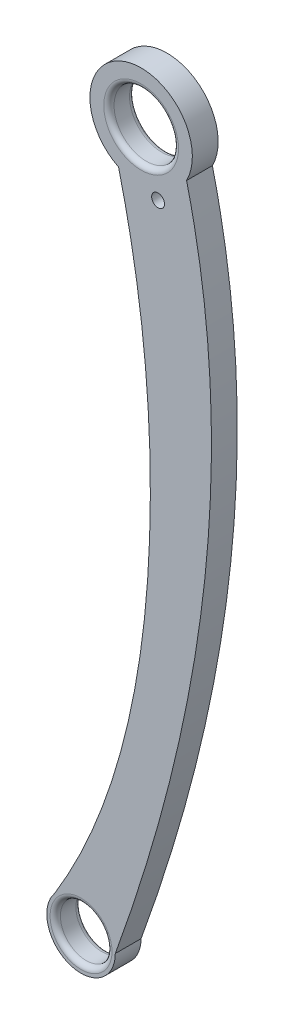
ISO-10303-21;
HEADER;
FILE_DESCRIPTION(('STEP AP214'),'2;1');
FILE_NAME('part.step','',(''),(''),'','','');
FILE_SCHEMA(('AUTOMOTIVE_DESIGN { 1 0 10303 214 1 1 1 1 }'));
ENDSEC;
DATA;
#1=APPLICATION_CONTEXT('core data for automotive mechanical design processes');
#2=APPLICATION_PROTOCOL_DEFINITION('international standard','automotive_design',2000,#1);
#3=PRODUCT_CONTEXT('',#1,'mechanical');
#4=PRODUCT('Part','Part','',(#3));
#5=PRODUCT_RELATED_PRODUCT_CATEGORY('part','',(#4));
#6=PRODUCT_DEFINITION_FORMATION('','',#4);
#7=PRODUCT_DEFINITION_CONTEXT('part definition',#1,'design');
#8=PRODUCT_DEFINITION('design','',#6,#7);
#9=PRODUCT_DEFINITION_SHAPE('','',#8);
#10=(LENGTH_UNIT() NAMED_UNIT(*) SI_UNIT(.MILLI.,.METRE.));
#11=(NAMED_UNIT(*) PLANE_ANGLE_UNIT() SI_UNIT($,.RADIAN.));
#12=(NAMED_UNIT(*) SI_UNIT($,.STERADIAN.) SOLID_ANGLE_UNIT());
#13=UNCERTAINTY_MEASURE_WITH_UNIT(LENGTH_MEASURE(1.E-05),#10,'distance_accuracy_value','');
#14=(GEOMETRIC_REPRESENTATION_CONTEXT(3) GLOBAL_UNCERTAINTY_ASSIGNED_CONTEXT((#13)) GLOBAL_UNIT_ASSIGNED_CONTEXT((#10,
#11,#12)) REPRESENTATION_CONTEXT('',''));
#15=CARTESIAN_POINT('',(0.,0.,0.));
#16=DIRECTION('',(0.,0.,1.));
#17=DIRECTION('',(1.,0.,0.));
#18=AXIS2_PLACEMENT_3D('',#15,#16,#17);
#19=CARTESIAN_POINT('',(5.31163662416243,0.,2.));
#20=CARTESIAN_POINT('',(18.3321974291525,35.9770453277798,2.));
#21=CARTESIAN_POINT('',(25.8524713877019,76.6433302799412,2.));
#22=CARTESIAN_POINT('',(15.073892360451,114.258525244082,2.));
#23=B_SPLINE_CURVE_WITH_KNOTS('',3,(#19,#20,#21,#22),.UNSPECIFIED.,.F.,.F.,(4,4),(0.,1.),.UNSPECIFIED.);
#24=DIRECTION('',(0.,0.,-1.));
#25=VECTOR('',#24,1.);
#26=SURFACE_OF_LINEAR_EXTRUSION('',#23,#25);
#27=CARTESIAN_POINT('',(5.31163662416243,0.,-2.));
#28=CARTESIAN_POINT('',(18.3321974291525,35.9770453277798,-2.));
#29=CARTESIAN_POINT('',(25.8524713877019,76.6433302799412,-2.));
#30=CARTESIAN_POINT('',(15.073892360451,114.258525244082,-2.));
#31=B_SPLINE_CURVE_WITH_KNOTS('',3,(#27,#28,#29,#30),.UNSPECIFIED.,.F.,.F.,(4,4),(0.,1.),.UNSPECIFIED.);
#32=CARTESIAN_POINT('',(5.31163662416243,0.,-2.));
#33=VERTEX_POINT('',#32);
#34=CARTESIAN_POINT('',(16.3701122695704,109.364122198897,-2.));
#35=VERTEX_POINT('',#34);
#36=EDGE_CURVE('E202',#33,#35,#31,.T.);
#37=ORIENTED_EDGE('',*,*,#36,.T.);
#38=DIRECTION('',(0.,0.,-1.));
#39=VECTOR('',#38,1.);
#40=CARTESIAN_POINT('',(16.3701122695704,109.364122198897,2.));
#41=LINE('',#40,#39);
#42=CARTESIAN_POINT('',(16.3701122695704,109.364122198897,2.));
#43=VERTEX_POINT('',#42);
#44=EDGE_CURVE('E98',#43,#35,#41,.T.);
#45=ORIENTED_EDGE('',*,*,#44,.F.);
#46=CARTESIAN_POINT('',(5.31163662416243,0.,2.));
#47=VERTEX_POINT('',#46);
#48=EDGE_CURVE('E88',#47,#43,#23,.T.);
#49=ORIENTED_EDGE('',*,*,#48,.F.);
#50=DIRECTION('',(0.,0.,-1.));
#51=VECTOR('',#50,1.);
#52=CARTESIAN_POINT('',(5.31163662416243,0.,2.));
#53=LINE('',#52,#51);
#54=EDGE_CURVE('E141',#47,#33,#53,.T.);
#55=ORIENTED_EDGE('',*,*,#54,.T.);
#56=EDGE_LOOP('',(#37,#45,#49,#55));
#57=FACE_BOUND('',#56,.T.);
#58=ADVANCED_FACE('F38',(#57),#26,.F.);
#59=CARTESIAN_POINT('',(9.32113061310812,113.027146637179,2.));
#60=DIRECTION('',(0.,0.,-1.));
#61=DIRECTION('',(-1.,0.,0.));
#62=AXIS2_PLACEMENT_3D('',#59,#60,#61);
#63=CYLINDRICAL_SURFACE('',#62,7.94392160262143);
#64=CARTESIAN_POINT('',(9.32113061310812,113.027146637179,-2.));
#65=DIRECTION('',(0.,0.,1.));
#66=DIRECTION('',(1.,0.,0.));
#67=AXIS2_PLACEMENT_3D('',#64,#65,#66);
#68=CIRCLE('',#67,7.94392160262143);
#69=CARTESIAN_POINT('',(5.81715706753299,105.897766592568,-2.));
#70=VERTEX_POINT('',#69);
#71=EDGE_CURVE('E94',#35,#70,#68,.T.);
#72=ORIENTED_EDGE('',*,*,#71,.T.);
#73=DIRECTION('',(0.,0.,-1.));
#74=VECTOR('',#73,1.);
#75=CARTESIAN_POINT('',(5.81715706753299,105.897766592568,2.));
#76=LINE('',#75,#74);
#77=CARTESIAN_POINT('',(5.81715706753299,105.897766592568,2.));
#78=VERTEX_POINT('',#77);
#79=EDGE_CURVE('E92',#78,#70,#76,.T.);
#80=ORIENTED_EDGE('',*,*,#79,.F.);
#81=CARTESIAN_POINT('',(9.32113061310812,113.027146637179,2.));
#82=DIRECTION('',(0.,0.,1.));
#83=DIRECTION('',(1.,0.,0.));
#84=AXIS2_PLACEMENT_3D('',#81,#82,#83);
#85=CIRCLE('',#84,7.94392160262143);
#86=EDGE_CURVE('E82',#43,#78,#85,.T.);
#87=ORIENTED_EDGE('',*,*,#86,.F.);
#88=ORIENTED_EDGE('',*,*,#44,.T.);
#89=EDGE_LOOP('',(#72,#80,#87,#88));
#90=FACE_BOUND('',#89,.T.);
#91=ADVANCED_FACE('F93',(#90),#63,.T.);
#92=CARTESIAN_POINT('',(-4.09240869032532,3.38610022570117,2.));
#93=CARTESIAN_POINT('',(6.99481274109593,21.5778753774316,2.));
#94=CARTESIAN_POINT('',(13.3983292409493,58.8073086424437,2.));
#95=CARTESIAN_POINT('',(8.88542603497178,94.5824072752989,2.));
#96=CARTESIAN_POINT('',(5.01139880141732,109.022552686911,2.));
#97=B_SPLINE_CURVE_WITH_KNOTS('',3,(#92,#93,#94,#95,#96),.UNSPECIFIED.,.F.,.F.,(4,1,4),(0.,
0.587614161687344,1.),.UNSPECIFIED.);
#98=DIRECTION('',(0.,0.,-1.));
#99=VECTOR('',#98,1.);
#100=SURFACE_OF_LINEAR_EXTRUSION('',#97,#99);
#101=CARTESIAN_POINT('',(-4.09240869032532,3.38610022570117,-2.));
#102=CARTESIAN_POINT('',(6.99481274109593,21.5778753774316,-2.));
#103=CARTESIAN_POINT('',(13.3983292409493,58.8073086424437,-2.));
#104=CARTESIAN_POINT('',(8.88542603497178,94.5824072752989,-2.));
#105=CARTESIAN_POINT('',(5.01139880141732,109.022552686911,-2.));
#106=B_SPLINE_CURVE_WITH_KNOTS('',3,(#101,#102,#103,#104,#105),.UNSPECIFIED.,.F.,.F.,(4,1,4),
(0.,0.587614161687344,1.),.UNSPECIFIED.);
#107=CARTESIAN_POINT('',(-4.09240869032532,3.38610022570117,-2.));
#108=VERTEX_POINT('',#107);
#109=EDGE_CURVE('E137',#108,#70,#106,.T.);
#110=ORIENTED_EDGE('',*,*,#109,.F.);
#111=DIRECTION('',(0.,0.,-1.));
#112=VECTOR('',#111,1.);
#113=CARTESIAN_POINT('',(-4.09240869032532,3.38610022570117,2.));
#114=LINE('',#113,#112);
#115=CARTESIAN_POINT('',(-4.09240869032532,3.38610022570117,2.));
#116=VERTEX_POINT('',#115);
#117=EDGE_CURVE('E71',#116,#108,#114,.T.);
#118=ORIENTED_EDGE('',*,*,#117,.F.);
#119=EDGE_CURVE('E86',#116,#78,#97,.T.);
#120=ORIENTED_EDGE('',*,*,#119,.T.);
#121=ORIENTED_EDGE('',*,*,#79,.T.);
#122=EDGE_LOOP('',(#110,#118,#120,#121));
#123=FACE_BOUND('',#122,.T.);
#124=ADVANCED_FACE('F100',(#123),#100,.T.);
#125=CARTESIAN_POINT('',(0.,0.,2.));
#126=DIRECTION('',(0.,0.,-1.));
#127=DIRECTION('',(-1.,0.,0.));
#128=AXIS2_PLACEMENT_3D('',#125,#126,#127);
#129=CYLINDRICAL_SURFACE('',#128,4.);
#130=CARTESIAN_POINT('',(0.,0.,-1.2));
#131=DIRECTION('',(0.,0.,1.));
#132=DIRECTION('',(1.,0.,0.));
#133=AXIS2_PLACEMENT_3D('',#130,#131,#132);
#134=CIRCLE('',#133,4.);
#135=CARTESIAN_POINT('',(4.,0.,-1.2));
#136=VERTEX_POINT('',#135);
#137=EDGE_CURVE('E154',#136,#136,#134,.F.);
#138=ORIENTED_EDGE('',*,*,#137,.T.);
#139=EDGE_LOOP('',(#138));
#140=FACE_BOUND('',#139,.T.);
#141=CARTESIAN_POINT('',(0.,0.,1.2));
#142=DIRECTION('',(0.,0.,1.));
#143=DIRECTION('',(1.,0.,0.));
#144=AXIS2_PLACEMENT_3D('',#141,#142,#143);
#145=CIRCLE('',#144,4.);
#146=CARTESIAN_POINT('',(4.,0.,1.2));
#147=VERTEX_POINT('',#146);
#148=EDGE_CURVE('E151',#147,#147,#145,.T.);
#149=ORIENTED_EDGE('',*,*,#148,.T.);
#150=EDGE_LOOP('',(#149));
#151=FACE_BOUND('',#150,.T.);
#152=ADVANCED_FACE('F116',(#140,#151),#129,.F.);
#153=CARTESIAN_POINT('',(11.9498646014563,104.478258332122,2.));
#154=DIRECTION('',(0.,0.,-1.));
#155=DIRECTION('',(-1.,0.,0.));
#156=AXIS2_PLACEMENT_3D('',#153,#154,#155);
#157=CYLINDRICAL_SURFACE('',#156,1.);
#158=CARTESIAN_POINT('',(11.9498646014563,104.478258332122,2.));
#159=DIRECTION('',(0.,0.,1.));
#160=DIRECTION('',(1.,0.,0.));
#161=AXIS2_PLACEMENT_3D('',#158,#159,#160);
#162=CIRCLE('',#161,1.);
#163=CARTESIAN_POINT('',(12.9498646014563,104.478258332122,2.));
#164=VERTEX_POINT('',#163);
#165=EDGE_CURVE('E102',#164,#164,#162,.T.);
#166=ORIENTED_EDGE('',*,*,#165,.T.);
#167=EDGE_LOOP('',(#166));
#168=FACE_BOUND('',#167,.T.);
#169=CARTESIAN_POINT('',(11.9498646014563,104.478258332122,-2.));
#170=DIRECTION('',(0.,0.,1.));
#171=DIRECTION('',(1.,0.,0.));
#172=AXIS2_PLACEMENT_3D('',#169,#170,#171);
#173=CIRCLE('',#172,1.);
#174=CARTESIAN_POINT('',(12.9498646014563,104.478258332122,-2.));
#175=VERTEX_POINT('',#174);
#176=EDGE_CURVE('E129',#175,#175,#173,.T.);
#177=ORIENTED_EDGE('',*,*,#176,.F.);
#178=EDGE_LOOP('',(#177));
#179=FACE_BOUND('',#178,.T.);
#180=ADVANCED_FACE('F191',(#168,#179),#157,.F.);
#181=CARTESIAN_POINT('',(0.,0.,2.));
#182=DIRECTION('',(0.,0.,-1.));
#183=DIRECTION('',(-1.,0.,0.));
#184=AXIS2_PLACEMENT_3D('',#181,#182,#183);
#185=CYLINDRICAL_SURFACE('',#184,5.31163662416243);
#186=CARTESIAN_POINT('',(0.,0.,-2.));
#187=DIRECTION('',(0.,0.,1.));
#188=DIRECTION('',(1.,0.,0.));
#189=AXIS2_PLACEMENT_3D('',#186,#187,#188);
#190=CIRCLE('',#189,5.31163662416243);
#191=EDGE_CURVE('E74',#108,#33,#190,.T.);
#192=ORIENTED_EDGE('',*,*,#191,.T.);
#193=ORIENTED_EDGE('',*,*,#54,.F.);
#194=CARTESIAN_POINT('',(0.,0.,2.));
#195=DIRECTION('',(0.,0.,1.));
#196=DIRECTION('',(1.,0.,0.));
#197=AXIS2_PLACEMENT_3D('',#194,#195,#196);
#198=CIRCLE('',#197,5.31163662416243);
#199=EDGE_CURVE('E55',#116,#47,#198,.T.);
#200=ORIENTED_EDGE('',*,*,#199,.F.);
#201=ORIENTED_EDGE('',*,*,#117,.T.);
#202=EDGE_LOOP('',(#192,#193,#200,#201));
#203=FACE_BOUND('',#202,.T.);
#204=ADVANCED_FACE('F117',(#203),#185,.T.);
#205=CARTESIAN_POINT('',(9.32113061310812,113.027146637179,2.));
#206=DIRECTION('',(0.,0.,-1.));
#207=DIRECTION('',(-1.,0.,0.));
#208=AXIS2_PLACEMENT_3D('',#205,#206,#207);
#209=CYLINDRICAL_SURFACE('',#208,5.);
#210=CARTESIAN_POINT('',(9.32113061310812,113.027146637179,-1.2));
#211=DIRECTION('',(0.,0.,1.));
#212=DIRECTION('',(1.,0.,0.));
#213=AXIS2_PLACEMENT_3D('',#210,#211,#212);
#214=CIRCLE('',#213,5.);
#215=CARTESIAN_POINT('',(14.3211306131081,113.027146637179,-1.2));
#216=VERTEX_POINT('',#215);
#217=EDGE_CURVE('E11',#216,#216,#214,.F.);
#218=ORIENTED_EDGE('',*,*,#217,.T.);
#219=EDGE_LOOP('',(#218));
#220=FACE_BOUND('',#219,.T.);
#221=CARTESIAN_POINT('',(9.32113061310812,113.027146637179,1.2));
#222=DIRECTION('',(0.,0.,1.));
#223=DIRECTION('',(1.,0.,0.));
#224=AXIS2_PLACEMENT_3D('',#221,#222,#223);
#225=CIRCLE('',#224,5.);
#226=CARTESIAN_POINT('',(14.3211306131081,113.027146637179,1.2));
#227=VERTEX_POINT('',#226);
#228=EDGE_CURVE('E47',#227,#227,#225,.T.);
#229=ORIENTED_EDGE('',*,*,#228,.T.);
#230=EDGE_LOOP('',(#229));
#231=FACE_BOUND('',#230,.T.);
#232=ADVANCED_FACE('F165',(#220,#231),#209,.F.);
#233=CARTESIAN_POINT('',(0.,0.,2.));
#234=DIRECTION('',(0.,0.,1.));
#235=DIRECTION('',(1.,0.,0.));
#236=AXIS2_PLACEMENT_3D('',#233,#234,#235);
#237=PLANE('',#236);
#238=CARTESIAN_POINT('',(0.,0.,2.));
#239=DIRECTION('',(0.,0.,1.));
#240=DIRECTION('',(1.,0.,0.));
#241=AXIS2_PLACEMENT_3D('',#238,#239,#240);
#242=CIRCLE('',#241,4.8);
#243=CARTESIAN_POINT('',(4.8,0.,2.));
#244=VERTEX_POINT('',#243);
#245=EDGE_CURVE('E160',#244,#244,#242,.F.);
#246=ORIENTED_EDGE('',*,*,#245,.T.);
#247=EDGE_LOOP('',(#246));
#248=FACE_BOUND('',#247,.T.);
#249=CARTESIAN_POINT('',(9.32113061310812,113.027146637179,2.));
#250=DIRECTION('',(0.,0.,1.));
#251=DIRECTION('',(1.,0.,0.));
#252=AXIS2_PLACEMENT_3D('',#249,#250,#251);
#253=CIRCLE('',#252,5.8);
#254=CARTESIAN_POINT('',(15.1211306131081,113.027146637179,2.));
#255=VERTEX_POINT('',#254);
#256=EDGE_CURVE('E157',#255,#255,#253,.F.);
#257=ORIENTED_EDGE('',*,*,#256,.T.);
#258=EDGE_LOOP('',(#257));
#259=FACE_BOUND('',#258,.T.);
#260=ORIENTED_EDGE('',*,*,#48,.T.);
#261=ORIENTED_EDGE('',*,*,#86,.T.);
#262=ORIENTED_EDGE('',*,*,#119,.F.);
#263=ORIENTED_EDGE('',*,*,#199,.T.);
#264=EDGE_LOOP('',(#260,#261,#262,#263));
#265=FACE_BOUND('',#264,.T.);
#266=ORIENTED_EDGE('',*,*,#165,.F.);
#267=EDGE_LOOP('',(#266));
#268=FACE_BOUND('',#267,.T.);
#269=ADVANCED_FACE('F83',(#248,#259,#265,#268),#237,.T.);
#270=CARTESIAN_POINT('',(0.,0.,-2.));
#271=DIRECTION('',(0.,0.,1.));
#272=DIRECTION('',(1.,0.,0.));
#273=AXIS2_PLACEMENT_3D('',#270,#271,#272);
#274=PLANE('',#273);
#275=CARTESIAN_POINT('',(0.,0.,-2.));
#276=DIRECTION('',(0.,0.,1.));
#277=DIRECTION('',(1.,0.,0.));
#278=AXIS2_PLACEMENT_3D('',#275,#276,#277);
#279=CIRCLE('',#278,4.8);
#280=CARTESIAN_POINT('',(4.8,0.,-2.));
#281=VERTEX_POINT('',#280);
#282=EDGE_CURVE('E148',#281,#281,#279,.T.);
#283=ORIENTED_EDGE('',*,*,#282,.T.);
#284=EDGE_LOOP('',(#283));
#285=FACE_BOUND('',#284,.T.);
#286=CARTESIAN_POINT('',(9.32113061310812,113.027146637179,-2.));
#287=DIRECTION('',(0.,0.,1.));
#288=DIRECTION('',(1.,0.,0.));
#289=AXIS2_PLACEMENT_3D('',#286,#287,#288);
#290=CIRCLE('',#289,5.8);
#291=CARTESIAN_POINT('',(15.1211306131081,113.027146637179,-2.));
#292=VERTEX_POINT('',#291);
#293=EDGE_CURVE('E145',#292,#292,#290,.T.);
#294=ORIENTED_EDGE('',*,*,#293,.T.);
#295=EDGE_LOOP('',(#294));
#296=FACE_BOUND('',#295,.T.);
#297=ORIENTED_EDGE('',*,*,#36,.F.);
#298=ORIENTED_EDGE('',*,*,#191,.F.);
#299=ORIENTED_EDGE('',*,*,#109,.T.);
#300=ORIENTED_EDGE('',*,*,#71,.F.);
#301=EDGE_LOOP('',(#297,#298,#299,#300));
#302=FACE_BOUND('',#301,.T.);
#303=ORIENTED_EDGE('',*,*,#176,.T.);
#304=EDGE_LOOP('',(#303));
#305=FACE_BOUND('',#304,.T.);
#306=ADVANCED_FACE('F178',(#285,#296,#302,#305),#274,.F.);
#307=CARTESIAN_POINT('',(0.,0.,-1.2));
#308=DIRECTION('',(0.,0.,1.));
#309=DIRECTION('',(1.,0.,0.));
#310=AXIS2_PLACEMENT_3D('',#307,#308,#309);
#311=TOROIDAL_SURFACE('',#310,4.8,0.8);
#312=ORIENTED_EDGE('',*,*,#137,.F.);
#313=EDGE_LOOP('',(#312));
#314=FACE_BOUND('',#313,.T.);
#315=ORIENTED_EDGE('',*,*,#282,.F.);
#316=EDGE_LOOP('',(#315));
#317=FACE_BOUND('',#316,.T.);
#318=ADVANCED_FACE('F124',(#314,#317),#311,.T.);
#319=CARTESIAN_POINT('',(0.,0.,1.2));
#320=DIRECTION('',(0.,0.,1.));
#321=DIRECTION('',(1.,0.,0.));
#322=AXIS2_PLACEMENT_3D('',#319,#320,#321);
#323=TOROIDAL_SURFACE('',#322,4.8,0.8);
#324=ORIENTED_EDGE('',*,*,#245,.F.);
#325=EDGE_LOOP('',(#324));
#326=FACE_BOUND('',#325,.T.);
#327=ORIENTED_EDGE('',*,*,#148,.F.);
#328=EDGE_LOOP('',(#327));
#329=FACE_BOUND('',#328,.T.);
#330=ADVANCED_FACE('F173',(#326,#329),#323,.T.);
#331=CARTESIAN_POINT('',(9.32113061310812,113.027146637179,-1.2));
#332=DIRECTION('',(0.,0.,1.));
#333=DIRECTION('',(1.,0.,0.));
#334=AXIS2_PLACEMENT_3D('',#331,#332,#333);
#335=TOROIDAL_SURFACE('',#334,5.8,0.8);
#336=ORIENTED_EDGE('',*,*,#217,.F.);
#337=EDGE_LOOP('',(#336));
#338=FACE_BOUND('',#337,.T.);
#339=ORIENTED_EDGE('',*,*,#293,.F.);
#340=EDGE_LOOP('',(#339));
#341=FACE_BOUND('',#340,.T.);
#342=ADVANCED_FACE('F168',(#338,#341),#335,.T.);
#343=CARTESIAN_POINT('',(9.32113061310812,113.027146637179,1.2));
#344=DIRECTION('',(0.,0.,1.));
#345=DIRECTION('',(1.,0.,0.));
#346=AXIS2_PLACEMENT_3D('',#343,#344,#345);
#347=TOROIDAL_SURFACE('',#346,5.8,0.8);
#348=ORIENTED_EDGE('',*,*,#256,.F.);
#349=EDGE_LOOP('',(#348));
#350=FACE_BOUND('',#349,.T.);
#351=ORIENTED_EDGE('',*,*,#228,.F.);
#352=EDGE_LOOP('',(#351));
#353=FACE_BOUND('',#352,.T.);
#354=ADVANCED_FACE('F40',(#350,#353),#347,.T.);
#355=CLOSED_SHELL('',(#58,#91,#124,#152,#180,#204,#232,#269,#306,#318,#330,#342,#354));
#356=MANIFOLD_SOLID_BREP('B2',#355);
#357=ADVANCED_BREP_SHAPE_REPRESENTATION('',(#18,#356),#14);
#358=SHAPE_DEFINITION_REPRESENTATION(#9,#357);
ENDSEC;
END-ISO-10303-21;
